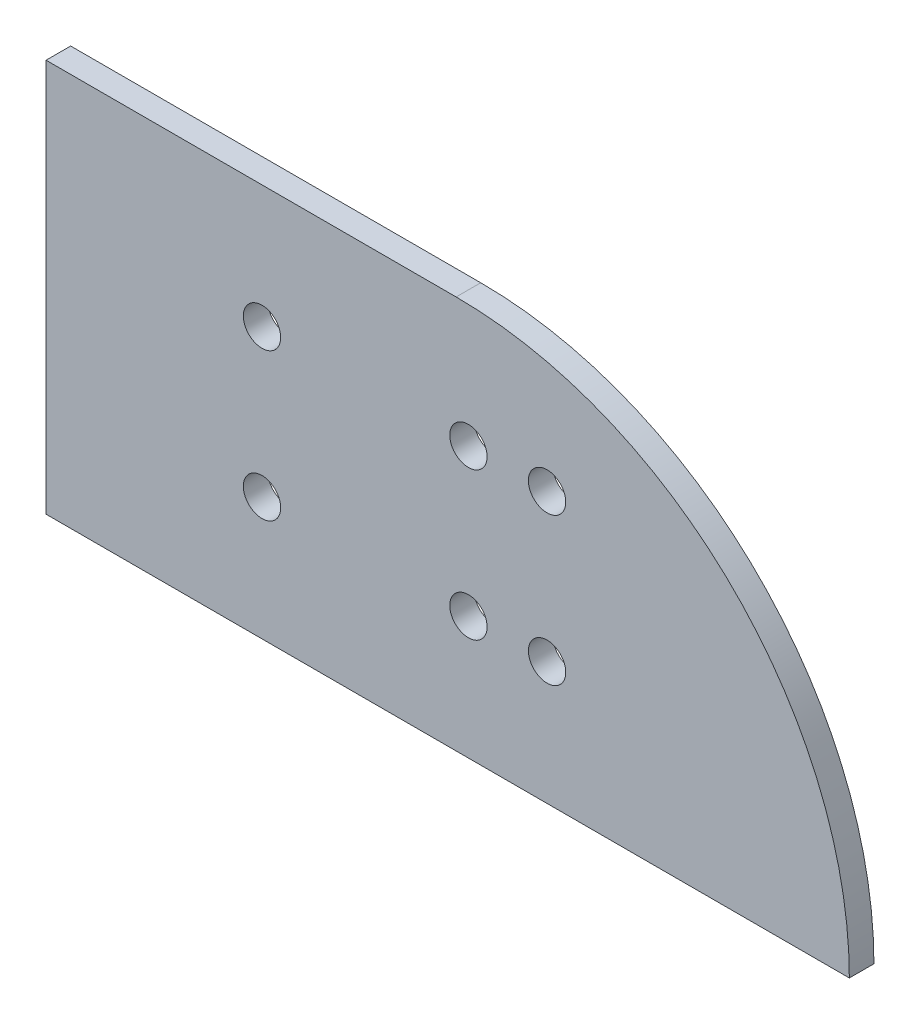
ISO-10303-21;
HEADER;
FILE_DESCRIPTION(('STEP AP214'),'2;1');
FILE_NAME('part.step','',(''),(''),'','','');
FILE_SCHEMA(('AUTOMOTIVE_DESIGN { 1 0 10303 214 1 1 1 1 }'));
ENDSEC;
DATA;
#1=APPLICATION_CONTEXT('core data for automotive mechanical design processes');
#2=APPLICATION_PROTOCOL_DEFINITION('international standard','automotive_design',2000,#1);
#3=PRODUCT_CONTEXT('',#1,'mechanical');
#4=PRODUCT('Part','Part','',(#3));
#5=PRODUCT_RELATED_PRODUCT_CATEGORY('part','',(#4));
#6=PRODUCT_DEFINITION_FORMATION('','',#4);
#7=PRODUCT_DEFINITION_CONTEXT('part definition',#1,'design');
#8=PRODUCT_DEFINITION('design','',#6,#7);
#9=PRODUCT_DEFINITION_SHAPE('','',#8);
#10=(LENGTH_UNIT() NAMED_UNIT(*) SI_UNIT(.MILLI.,.METRE.));
#11=(NAMED_UNIT(*) PLANE_ANGLE_UNIT() SI_UNIT($,.RADIAN.));
#12=(NAMED_UNIT(*) SI_UNIT($,.STERADIAN.) SOLID_ANGLE_UNIT());
#13=UNCERTAINTY_MEASURE_WITH_UNIT(LENGTH_MEASURE(1.E-05),#10,'distance_accuracy_value','');
#14=(GEOMETRIC_REPRESENTATION_CONTEXT(3) GLOBAL_UNCERTAINTY_ASSIGNED_CONTEXT((#13)) GLOBAL_UNIT_ASSIGNED_CONTEXT((#10,
#11,#12)) REPRESENTATION_CONTEXT('',''));
#15=CARTESIAN_POINT('',(0.,0.,0.));
#16=DIRECTION('',(0.,0.,1.));
#17=DIRECTION('',(1.,0.,0.));
#18=AXIS2_PLACEMENT_3D('',#15,#16,#17);
#19=CARTESIAN_POINT('',(52.9789755157234,0.,3.175));
#20=DIRECTION('',(0.,0.,-1.));
#21=DIRECTION('',(-1.,0.,0.));
#22=AXIS2_PLACEMENT_3D('',#19,#20,#21);
#23=CYLINDRICAL_SURFACE('',#22,50.8);
#24=CARTESIAN_POINT('',(52.9789755157234,0.,0.));
#25=DIRECTION('',(0.,0.,1.));
#26=DIRECTION('',(1.,0.,0.));
#27=AXIS2_PLACEMENT_3D('',#24,#25,#26);
#28=CIRCLE('',#27,50.8);
#29=CARTESIAN_POINT('',(103.778975515723,0.,0.));
#30=VERTEX_POINT('',#29);
#31=CARTESIAN_POINT('',(52.9789755157234,50.8,0.));
#32=VERTEX_POINT('',#31);
#33=EDGE_CURVE('E96',#30,#32,#28,.T.);
#34=ORIENTED_EDGE('',*,*,#33,.T.);
#35=DIRECTION('',(0.,0.,-1.));
#36=VECTOR('',#35,1.);
#37=CARTESIAN_POINT('',(52.9789755157234,50.8,3.175));
#38=LINE('',#37,#36);
#39=CARTESIAN_POINT('',(52.9789755157234,50.8,3.175));
#40=VERTEX_POINT('',#39);
#41=EDGE_CURVE('E11',#40,#32,#38,.T.);
#42=ORIENTED_EDGE('',*,*,#41,.F.);
#43=CARTESIAN_POINT('',(52.9789755157234,0.,3.175));
#44=DIRECTION('',(0.,0.,1.));
#45=DIRECTION('',(1.,0.,0.));
#46=AXIS2_PLACEMENT_3D('',#43,#44,#45);
#47=CIRCLE('',#46,50.8);
#48=CARTESIAN_POINT('',(103.778975515723,0.,3.175));
#49=VERTEX_POINT('',#48);
#50=EDGE_CURVE('E84',#49,#40,#47,.T.);
#51=ORIENTED_EDGE('',*,*,#50,.F.);
#52=DIRECTION('',(0.,0.,-1.));
#53=VECTOR('',#52,1.);
#54=CARTESIAN_POINT('',(103.778975515723,0.,3.175));
#55=LINE('',#54,#53);
#56=EDGE_CURVE('E92',#49,#30,#55,.T.);
#57=ORIENTED_EDGE('',*,*,#56,.T.);
#58=EDGE_LOOP('',(#34,#42,#51,#57));
#59=FACE_BOUND('',#58,.T.);
#60=ADVANCED_FACE('F33',(#59),#23,.T.);
#61=CARTESIAN_POINT('',(52.9789755157234,50.8,3.175));
#62=DIRECTION('',(0.,-1.,0.));
#63=DIRECTION('',(1.,0.,0.));
#64=AXIS2_PLACEMENT_3D('',#61,#62,#63);
#65=PLANE('',#64);
#66=DIRECTION('',(-1.,0.,0.));
#67=VECTOR('',#66,1.);
#68=CARTESIAN_POINT('',(52.9789755157234,50.8,0.));
#69=LINE('',#68,#67);
#70=CARTESIAN_POINT('',(0.,50.8,0.));
#71=VERTEX_POINT('',#70);
#72=EDGE_CURVE('E88',#32,#71,#69,.T.);
#73=ORIENTED_EDGE('',*,*,#72,.T.);
#74=DIRECTION('',(0.,0.,-1.));
#75=VECTOR('',#74,1.);
#76=CARTESIAN_POINT('',(0.,50.8,3.175));
#77=LINE('',#76,#75);
#78=CARTESIAN_POINT('',(0.,50.8,3.175));
#79=VERTEX_POINT('',#78);
#80=EDGE_CURVE('E41',#79,#71,#77,.T.);
#81=ORIENTED_EDGE('',*,*,#80,.F.);
#82=DIRECTION('',(-1.,0.,0.));
#83=VECTOR('',#82,1.);
#84=CARTESIAN_POINT('',(52.9789755157234,50.8,3.175));
#85=LINE('',#84,#83);
#86=EDGE_CURVE('E79',#40,#79,#85,.T.);
#87=ORIENTED_EDGE('',*,*,#86,.F.);
#88=ORIENTED_EDGE('',*,*,#41,.T.);
#89=EDGE_LOOP('',(#73,#81,#87,#88));
#90=FACE_BOUND('',#89,.T.);
#91=ADVANCED_FACE('F87',(#90),#65,.F.);
#92=CARTESIAN_POINT('',(0.,50.8,3.175));
#93=DIRECTION('',(1.,0.,0.));
#94=DIRECTION('',(0.,0.,-1.));
#95=AXIS2_PLACEMENT_3D('',#92,#93,#94);
#96=PLANE('',#95);
#97=DIRECTION('',(0.,-1.,0.));
#98=VECTOR('',#97,1.);
#99=CARTESIAN_POINT('',(0.,50.8,0.));
#100=LINE('',#99,#98);
#101=CARTESIAN_POINT('',(0.,0.,0.));
#102=VERTEX_POINT('',#101);
#103=EDGE_CURVE('E66',#71,#102,#100,.T.);
#104=ORIENTED_EDGE('',*,*,#103,.T.);
#105=DIRECTION('',(0.,0.,-1.));
#106=VECTOR('',#105,1.);
#107=CARTESIAN_POINT('',(0.,0.,3.175));
#108=LINE('',#107,#106);
#109=CARTESIAN_POINT('',(0.,0.,3.175));
#110=VERTEX_POINT('',#109);
#111=EDGE_CURVE('E89',#110,#102,#108,.T.);
#112=ORIENTED_EDGE('',*,*,#111,.F.);
#113=DIRECTION('',(0.,-1.,0.));
#114=VECTOR('',#113,1.);
#115=CARTESIAN_POINT('',(0.,50.8,3.175));
#116=LINE('',#115,#114);
#117=EDGE_CURVE('E82',#79,#110,#116,.T.);
#118=ORIENTED_EDGE('',*,*,#117,.F.);
#119=ORIENTED_EDGE('',*,*,#80,.T.);
#120=EDGE_LOOP('',(#104,#112,#118,#119));
#121=FACE_BOUND('',#120,.T.);
#122=ADVANCED_FACE('F90',(#121),#96,.F.);
#123=CARTESIAN_POINT('',(0.,0.,3.175));
#124=DIRECTION('',(0.,1.,0.));
#125=DIRECTION('',(0.,0.,1.));
#126=AXIS2_PLACEMENT_3D('',#123,#124,#125);
#127=PLANE('',#126);
#128=DIRECTION('',(1.,0.,0.));
#129=VECTOR('',#128,1.);
#130=CARTESIAN_POINT('',(0.,0.,0.));
#131=LINE('',#130,#129);
#132=EDGE_CURVE('E72',#102,#30,#131,.T.);
#133=ORIENTED_EDGE('',*,*,#132,.T.);
#134=ORIENTED_EDGE('',*,*,#56,.F.);
#135=DIRECTION('',(1.,0.,0.));
#136=VECTOR('',#135,1.);
#137=CARTESIAN_POINT('',(0.,0.,3.175));
#138=LINE('',#137,#136);
#139=EDGE_CURVE('E49',#110,#49,#138,.T.);
#140=ORIENTED_EDGE('',*,*,#139,.F.);
#141=ORIENTED_EDGE('',*,*,#111,.T.);
#142=EDGE_LOOP('',(#133,#134,#140,#141));
#143=FACE_BOUND('',#142,.T.);
#144=ADVANCED_FACE('F104',(#143),#127,.F.);
#145=CARTESIAN_POINT('',(52.9789755157234,0.,3.175));
#146=DIRECTION('',(0.,0.,1.));
#147=DIRECTION('',(1.,0.,0.));
#148=AXIS2_PLACEMENT_3D('',#145,#146,#147);
#149=PLANE('',#148);
#150=CARTESIAN_POINT('',(54.5664755157234,34.9249999999996,3.175));
#151=DIRECTION('',(0.,0.,1.));
#152=DIRECTION('',(1.,0.,0.));
#153=AXIS2_PLACEMENT_3D('',#150,#151,#152);
#154=CIRCLE('',#153,2.41299999999999);
#155=CARTESIAN_POINT('',(56.9794755157234,34.9249999999996,3.175));
#156=VERTEX_POINT('',#155);
#157=EDGE_CURVE('E99',#156,#156,#154,.T.);
#158=ORIENTED_EDGE('',*,*,#157,.F.);
#159=EDGE_LOOP('',(#158));
#160=FACE_BOUND('',#159,.T.);
#161=CARTESIAN_POINT('',(27.8964755157234,34.9249999999995,3.175));
#162=DIRECTION('',(0.,0.,1.));
#163=DIRECTION('',(1.,0.,0.));
#164=AXIS2_PLACEMENT_3D('',#161,#162,#163);
#165=CIRCLE('',#164,2.41300000000004);
#166=CARTESIAN_POINT('',(30.3094755157234,34.9249999999995,3.175));
#167=VERTEX_POINT('',#166);
#168=EDGE_CURVE('E112',#167,#167,#165,.T.);
#169=ORIENTED_EDGE('',*,*,#168,.F.);
#170=EDGE_LOOP('',(#169));
#171=FACE_BOUND('',#170,.T.);
#172=CARTESIAN_POINT('',(27.8964755157234,15.8749999999995,3.175));
#173=DIRECTION('',(0.,0.,1.));
#174=DIRECTION('',(1.,0.,0.));
#175=AXIS2_PLACEMENT_3D('',#172,#173,#174);
#176=CIRCLE('',#175,2.41300000000004);
#177=CARTESIAN_POINT('',(30.3094755157234,15.8749999999995,3.175));
#178=VERTEX_POINT('',#177);
#179=EDGE_CURVE('E115',#178,#178,#176,.T.);
#180=ORIENTED_EDGE('',*,*,#179,.F.);
#181=EDGE_LOOP('',(#180));
#182=FACE_BOUND('',#181,.T.);
#183=CARTESIAN_POINT('',(64.7264755157234,34.9249999999995,3.175));
#184=DIRECTION('',(0.,0.,1.));
#185=DIRECTION('',(1.,0.,0.));
#186=AXIS2_PLACEMENT_3D('',#183,#184,#185);
#187=CIRCLE('',#186,2.41300000000005);
#188=CARTESIAN_POINT('',(67.1394755157234,34.9249999999995,3.175));
#189=VERTEX_POINT('',#188);
#190=EDGE_CURVE('E118',#189,#189,#187,.T.);
#191=ORIENTED_EDGE('',*,*,#190,.F.);
#192=EDGE_LOOP('',(#191));
#193=FACE_BOUND('',#192,.T.);
#194=CARTESIAN_POINT('',(54.5664755157234,15.8749999999996,3.175));
#195=DIRECTION('',(0.,0.,1.));
#196=DIRECTION('',(1.,0.,0.));
#197=AXIS2_PLACEMENT_3D('',#194,#195,#196);
#198=CIRCLE('',#197,2.413);
#199=CARTESIAN_POINT('',(56.9794755157234,15.8749999999996,3.175));
#200=VERTEX_POINT('',#199);
#201=EDGE_CURVE('E121',#200,#200,#198,.T.);
#202=ORIENTED_EDGE('',*,*,#201,.F.);
#203=EDGE_LOOP('',(#202));
#204=FACE_BOUND('',#203,.T.);
#205=CARTESIAN_POINT('',(64.7264755157234,15.8749999999995,3.175));
#206=DIRECTION('',(0.,0.,1.));
#207=DIRECTION('',(1.,0.,0.));
#208=AXIS2_PLACEMENT_3D('',#205,#206,#207);
#209=CIRCLE('',#208,2.41300000000005);
#210=CARTESIAN_POINT('',(67.1394755157234,15.8749999999995,3.175));
#211=VERTEX_POINT('',#210);
#212=EDGE_CURVE('E124',#211,#211,#209,.T.);
#213=ORIENTED_EDGE('',*,*,#212,.F.);
#214=EDGE_LOOP('',(#213));
#215=FACE_BOUND('',#214,.T.);
#216=ORIENTED_EDGE('',*,*,#50,.T.);
#217=ORIENTED_EDGE('',*,*,#86,.T.);
#218=ORIENTED_EDGE('',*,*,#117,.T.);
#219=ORIENTED_EDGE('',*,*,#139,.T.);
#220=EDGE_LOOP('',(#216,#217,#218,#219));
#221=FACE_BOUND('',#220,.T.);
#222=ADVANCED_FACE('F80',(#160,#171,#182,#193,#204,#215,#221),#149,.T.);
#223=CARTESIAN_POINT('',(52.9789755157234,0.,0.));
#224=DIRECTION('',(0.,0.,1.));
#225=DIRECTION('',(1.,0.,0.));
#226=AXIS2_PLACEMENT_3D('',#223,#224,#225);
#227=PLANE('',#226);
#228=CARTESIAN_POINT('',(54.5664755157234,34.9249999999996,0.));
#229=DIRECTION('',(0.,0.,1.));
#230=DIRECTION('',(1.,0.,0.));
#231=AXIS2_PLACEMENT_3D('',#228,#229,#230);
#232=CIRCLE('',#231,2.41299999999999);
#233=CARTESIAN_POINT('',(56.9794755157234,34.9249999999996,0.));
#234=VERTEX_POINT('',#233);
#235=EDGE_CURVE('E137',#234,#234,#232,.T.);
#236=ORIENTED_EDGE('',*,*,#235,.T.);
#237=EDGE_LOOP('',(#236));
#238=FACE_BOUND('',#237,.T.);
#239=CARTESIAN_POINT('',(27.8964755157234,34.9249999999995,0.));
#240=DIRECTION('',(0.,0.,1.));
#241=DIRECTION('',(1.,0.,0.));
#242=AXIS2_PLACEMENT_3D('',#239,#240,#241);
#243=CIRCLE('',#242,2.41300000000004);
#244=CARTESIAN_POINT('',(30.3094755157234,34.9249999999995,0.));
#245=VERTEX_POINT('',#244);
#246=EDGE_CURVE('E134',#245,#245,#243,.T.);
#247=ORIENTED_EDGE('',*,*,#246,.T.);
#248=EDGE_LOOP('',(#247));
#249=FACE_BOUND('',#248,.T.);
#250=CARTESIAN_POINT('',(27.8964755157234,15.8749999999995,0.));
#251=DIRECTION('',(0.,0.,1.));
#252=DIRECTION('',(1.,0.,0.));
#253=AXIS2_PLACEMENT_3D('',#250,#251,#252);
#254=CIRCLE('',#253,2.41300000000004);
#255=CARTESIAN_POINT('',(30.3094755157234,15.8749999999995,0.));
#256=VERTEX_POINT('',#255);
#257=EDGE_CURVE('E131',#256,#256,#254,.T.);
#258=ORIENTED_EDGE('',*,*,#257,.T.);
#259=EDGE_LOOP('',(#258));
#260=FACE_BOUND('',#259,.T.);
#261=CARTESIAN_POINT('',(64.7264755157234,34.9249999999995,0.));
#262=DIRECTION('',(0.,0.,1.));
#263=DIRECTION('',(1.,0.,0.));
#264=AXIS2_PLACEMENT_3D('',#261,#262,#263);
#265=CIRCLE('',#264,2.41300000000005);
#266=CARTESIAN_POINT('',(67.1394755157234,34.9249999999995,0.));
#267=VERTEX_POINT('',#266);
#268=EDGE_CURVE('E130',#267,#267,#265,.T.);
#269=ORIENTED_EDGE('',*,*,#268,.T.);
#270=EDGE_LOOP('',(#269));
#271=FACE_BOUND('',#270,.T.);
#272=CARTESIAN_POINT('',(54.5664755157234,15.8749999999996,0.));
#273=DIRECTION('',(0.,0.,1.));
#274=DIRECTION('',(1.,0.,0.));
#275=AXIS2_PLACEMENT_3D('',#272,#273,#274);
#276=CIRCLE('',#275,2.413);
#277=CARTESIAN_POINT('',(56.9794755157234,15.8749999999996,0.));
#278=VERTEX_POINT('',#277);
#279=EDGE_CURVE('E140',#278,#278,#276,.T.);
#280=ORIENTED_EDGE('',*,*,#279,.T.);
#281=EDGE_LOOP('',(#280));
#282=FACE_BOUND('',#281,.T.);
#283=CARTESIAN_POINT('',(64.7264755157234,15.8749999999995,0.));
#284=DIRECTION('',(0.,0.,1.));
#285=DIRECTION('',(1.,0.,0.));
#286=AXIS2_PLACEMENT_3D('',#283,#284,#285);
#287=CIRCLE('',#286,2.41300000000005);
#288=CARTESIAN_POINT('',(67.1394755157234,15.8749999999995,0.));
#289=VERTEX_POINT('',#288);
#290=EDGE_CURVE('E127',#289,#289,#287,.T.);
#291=ORIENTED_EDGE('',*,*,#290,.T.);
#292=EDGE_LOOP('',(#291));
#293=FACE_BOUND('',#292,.T.);
#294=ORIENTED_EDGE('',*,*,#33,.F.);
#295=ORIENTED_EDGE('',*,*,#132,.F.);
#296=ORIENTED_EDGE('',*,*,#103,.F.);
#297=ORIENTED_EDGE('',*,*,#72,.F.);
#298=EDGE_LOOP('',(#294,#295,#296,#297));
#299=FACE_BOUND('',#298,.T.);
#300=ADVANCED_FACE('F107',(#238,#249,#260,#271,#282,#293,#299),#227,.F.);
#301=CARTESIAN_POINT('',(64.7264755157234,15.8749999999995,0.));
#302=DIRECTION('',(0.,0.,1.));
#303=DIRECTION('',(1.,0.,0.));
#304=AXIS2_PLACEMENT_3D('',#301,#302,#303);
#305=CYLINDRICAL_SURFACE('',#304,2.41300000000005);
#306=ORIENTED_EDGE('',*,*,#212,.T.);
#307=EDGE_LOOP('',(#306));
#308=FACE_BOUND('',#307,.T.);
#309=ORIENTED_EDGE('',*,*,#290,.F.);
#310=EDGE_LOOP('',(#309));
#311=FACE_BOUND('',#310,.T.);
#312=ADVANCED_FACE('F151',(#308,#311),#305,.F.);
#313=CARTESIAN_POINT('',(54.5664755157234,15.8749999999996,0.));
#314=DIRECTION('',(0.,0.,1.));
#315=DIRECTION('',(1.,0.,0.));
#316=AXIS2_PLACEMENT_3D('',#313,#314,#315);
#317=CYLINDRICAL_SURFACE('',#316,2.413);
#318=ORIENTED_EDGE('',*,*,#201,.T.);
#319=EDGE_LOOP('',(#318));
#320=FACE_BOUND('',#319,.T.);
#321=ORIENTED_EDGE('',*,*,#279,.F.);
#322=EDGE_LOOP('',(#321));
#323=FACE_BOUND('',#322,.T.);
#324=ADVANCED_FACE('F148',(#320,#323),#317,.F.);
#325=CARTESIAN_POINT('',(64.7264755157234,34.9249999999995,0.));
#326=DIRECTION('',(0.,0.,1.));
#327=DIRECTION('',(1.,0.,0.));
#328=AXIS2_PLACEMENT_3D('',#325,#326,#327);
#329=CYLINDRICAL_SURFACE('',#328,2.41300000000005);
#330=ORIENTED_EDGE('',*,*,#190,.T.);
#331=EDGE_LOOP('',(#330));
#332=FACE_BOUND('',#331,.T.);
#333=ORIENTED_EDGE('',*,*,#268,.F.);
#334=EDGE_LOOP('',(#333));
#335=FACE_BOUND('',#334,.T.);
#336=ADVANCED_FACE('F150',(#332,#335),#329,.F.);
#337=CARTESIAN_POINT('',(27.8964755157234,15.8749999999995,0.));
#338=DIRECTION('',(0.,0.,1.));
#339=DIRECTION('',(1.,0.,0.));
#340=AXIS2_PLACEMENT_3D('',#337,#338,#339);
#341=CYLINDRICAL_SURFACE('',#340,2.41300000000004);
#342=ORIENTED_EDGE('',*,*,#179,.T.);
#343=EDGE_LOOP('',(#342));
#344=FACE_BOUND('',#343,.T.);
#345=ORIENTED_EDGE('',*,*,#257,.F.);
#346=EDGE_LOOP('',(#345));
#347=FACE_BOUND('',#346,.T.);
#348=ADVANCED_FACE('F158',(#344,#347),#341,.F.);
#349=CARTESIAN_POINT('',(27.8964755157234,34.9249999999995,0.));
#350=DIRECTION('',(0.,0.,1.));
#351=DIRECTION('',(1.,0.,0.));
#352=AXIS2_PLACEMENT_3D('',#349,#350,#351);
#353=CYLINDRICAL_SURFACE('',#352,2.41300000000004);
#354=ORIENTED_EDGE('',*,*,#168,.T.);
#355=EDGE_LOOP('',(#354));
#356=FACE_BOUND('',#355,.T.);
#357=ORIENTED_EDGE('',*,*,#246,.F.);
#358=EDGE_LOOP('',(#357));
#359=FACE_BOUND('',#358,.T.);
#360=ADVANCED_FACE('F182',(#356,#359),#353,.F.);
#361=CARTESIAN_POINT('',(54.5664755157234,34.9249999999996,0.));
#362=DIRECTION('',(0.,0.,1.));
#363=DIRECTION('',(1.,0.,0.));
#364=AXIS2_PLACEMENT_3D('',#361,#362,#363);
#365=CYLINDRICAL_SURFACE('',#364,2.41299999999999);
#366=ORIENTED_EDGE('',*,*,#157,.T.);
#367=EDGE_LOOP('',(#366));
#368=FACE_BOUND('',#367,.T.);
#369=ORIENTED_EDGE('',*,*,#235,.F.);
#370=EDGE_LOOP('',(#369));
#371=FACE_BOUND('',#370,.T.);
#372=ADVANCED_FACE('F185',(#368,#371),#365,.F.);
#373=CLOSED_SHELL('',(#60,#91,#122,#144,#222,#300,#312,#324,#336,#348,#360,#372));
#374=MANIFOLD_SOLID_BREP('B2',#373);
#375=ADVANCED_BREP_SHAPE_REPRESENTATION('',(#18,#374),#14);
#376=SHAPE_DEFINITION_REPRESENTATION(#9,#375);
ENDSEC;
END-ISO-10303-21;
